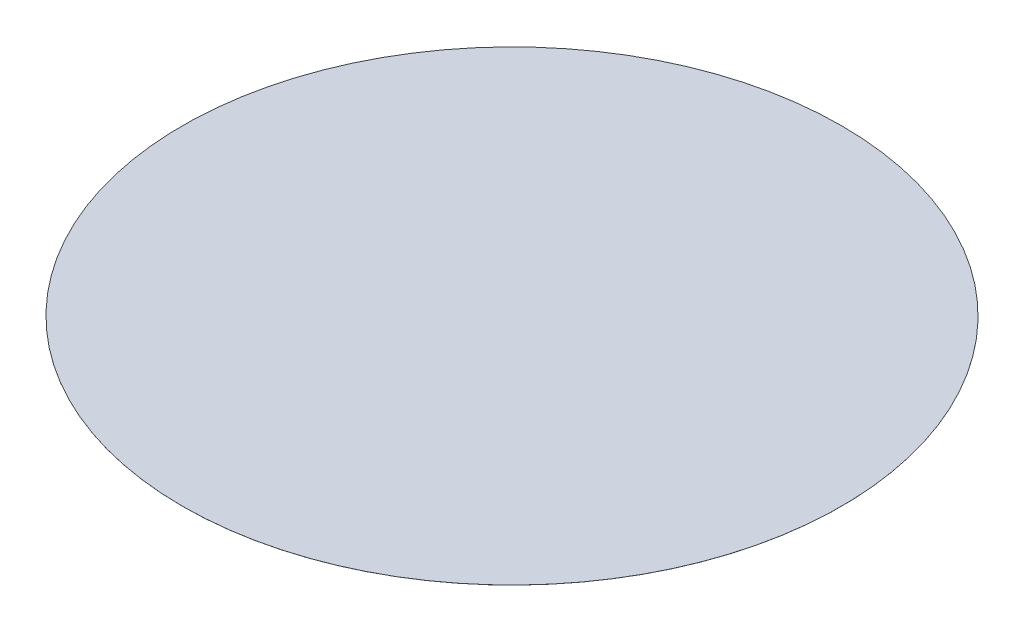
ISO-10303-21;
HEADER;
FILE_DESCRIPTION(('STEP AP214'),'2;1');
FILE_NAME('part.step','',(''),(''),'','','');
FILE_SCHEMA(('AUTOMOTIVE_DESIGN { 1 0 10303 214 1 1 1 1 }'));
ENDSEC;
DATA;
#1=APPLICATION_CONTEXT('core data for automotive mechanical design processes');
#2=APPLICATION_PROTOCOL_DEFINITION('international standard','automotive_design',2000,#1);
#3=PRODUCT_CONTEXT('',#1,'mechanical');
#4=PRODUCT('Part','Part','',(#3));
#5=PRODUCT_RELATED_PRODUCT_CATEGORY('part','',(#4));
#6=PRODUCT_DEFINITION_FORMATION('','',#4);
#7=PRODUCT_DEFINITION_CONTEXT('part definition',#1,'design');
#8=PRODUCT_DEFINITION('design','',#6,#7);
#9=PRODUCT_DEFINITION_SHAPE('','',#8);
#10=(LENGTH_UNIT() NAMED_UNIT(*) SI_UNIT(.MILLI.,.METRE.));
#11=(NAMED_UNIT(*) PLANE_ANGLE_UNIT() SI_UNIT($,.RADIAN.));
#12=(NAMED_UNIT(*) SI_UNIT($,.STERADIAN.) SOLID_ANGLE_UNIT());
#13=UNCERTAINTY_MEASURE_WITH_UNIT(LENGTH_MEASURE(1.E-05),#10,'distance_accuracy_value','');
#14=(GEOMETRIC_REPRESENTATION_CONTEXT(3) GLOBAL_UNCERTAINTY_ASSIGNED_CONTEXT((#13)) GLOBAL_UNIT_ASSIGNED_CONTEXT((#10,
#11,#12)) REPRESENTATION_CONTEXT('',''));
#15=CARTESIAN_POINT('',(0.,0.,0.));
#16=DIRECTION('',(0.,0.,1.));
#17=DIRECTION('',(1.,0.,0.));
#18=AXIS2_PLACEMENT_3D('',#15,#16,#17);
#19=CARTESIAN_POINT('',(0.,16.51,0.));
#20=DIRECTION('',(0.,-1.,0.));
#21=DIRECTION('',(0.,0.,-1.));
#22=AXIS2_PLACEMENT_3D('',#19,#20,#21);
#23=CYLINDRICAL_SURFACE('',#22,63.5);
#24=CARTESIAN_POINT('',(0.,16.51,0.));
#25=DIRECTION('',(0.,1.,0.));
#26=DIRECTION('',(0.,0.,1.));
#27=AXIS2_PLACEMENT_3D('',#24,#25,#26);
#28=CIRCLE('',#27,63.5);
#29=CARTESIAN_POINT('',(0.,16.51,63.5));
#30=VERTEX_POINT('',#29);
#31=EDGE_CURVE('E11',#30,#30,#28,.T.);
#32=ORIENTED_EDGE('',*,*,#31,.F.);
#33=EDGE_LOOP('',(#32));
#34=FACE_BOUND('',#33,.T.);
#35=CARTESIAN_POINT('',(0.,16.5,0.));
#36=DIRECTION('',(0.,1.,0.));
#37=DIRECTION('',(0.,0.,1.));
#38=AXIS2_PLACEMENT_3D('',#35,#36,#37);
#39=CIRCLE('',#38,63.5);
#40=CARTESIAN_POINT('',(0.,16.5,63.5));
#41=VERTEX_POINT('',#40);
#42=EDGE_CURVE('E48',#41,#41,#39,.T.);
#43=ORIENTED_EDGE('',*,*,#42,.T.);
#44=EDGE_LOOP('',(#43));
#45=FACE_BOUND('',#44,.T.);
#46=ADVANCED_FACE('F45',(#34,#45),#23,.T.);
#47=CARTESIAN_POINT('',(0.,16.51,0.));
#48=DIRECTION('',(0.,1.,0.));
#49=DIRECTION('',(0.,0.,1.));
#50=AXIS2_PLACEMENT_3D('',#47,#48,#49);
#51=PLANE('',#50);
#52=ORIENTED_EDGE('',*,*,#31,.T.);
#53=EDGE_LOOP('',(#52));
#54=FACE_BOUND('',#53,.T.);
#55=ADVANCED_FACE('F60',(#54),#51,.T.);
#56=CARTESIAN_POINT('',(0.,16.5,0.));
#57=DIRECTION('',(0.,1.,0.));
#58=DIRECTION('',(0.,0.,1.));
#59=AXIS2_PLACEMENT_3D('',#56,#57,#58);
#60=PLANE('',#59);
#61=ORIENTED_EDGE('',*,*,#42,.F.);
#62=EDGE_LOOP('',(#61));
#63=FACE_BOUND('',#62,.T.);
#64=ADVANCED_FACE('F58',(#63),#60,.F.);
#65=CLOSED_SHELL('',(#46,#55,#64));
#66=MANIFOLD_SOLID_BREP('B2',#65);
#67=CARTESIAN_POINT('',(0.,15.5,0.));
#68=DIRECTION('',(0.,-1.,0.));
#69=DIRECTION('',(0.,0.,-1.));
#70=AXIS2_PLACEMENT_3D('',#67,#68,#69);
#71=CYLINDRICAL_SURFACE('',#70,10.65);
#72=CARTESIAN_POINT('',(0.,15.5,0.));
#73=DIRECTION('',(0.,1.,0.));
#74=DIRECTION('',(0.,0.,1.));
#75=AXIS2_PLACEMENT_3D('',#72,#73,#74);
#76=CIRCLE('',#75,10.65);
#77=CARTESIAN_POINT('',(0.,15.5,10.65));
#78=VERTEX_POINT('',#77);
#79=EDGE_CURVE('E44',#78,#78,#76,.T.);
#80=ORIENTED_EDGE('',*,*,#79,.F.);
#81=EDGE_LOOP('',(#80));
#82=FACE_BOUND('',#81,.T.);
#83=CARTESIAN_POINT('',(0.,0.,0.));
#84=DIRECTION('',(0.,1.,0.));
#85=DIRECTION('',(0.,0.,1.));
#86=AXIS2_PLACEMENT_3D('',#83,#84,#85);
#87=CIRCLE('',#86,10.65);
#88=CARTESIAN_POINT('',(0.,0.,10.65));
#89=VERTEX_POINT('',#88);
#90=EDGE_CURVE('E89',#89,#89,#87,.T.);
#91=ORIENTED_EDGE('',*,*,#90,.T.);
#92=EDGE_LOOP('',(#91));
#93=FACE_BOUND('',#92,.T.);
#94=ADVANCED_FACE('F86',(#82,#93),#71,.T.);
#95=CARTESIAN_POINT('',(0.,15.5,0.));
#96=DIRECTION('',(0.,1.,0.));
#97=DIRECTION('',(0.,0.,1.));
#98=AXIS2_PLACEMENT_3D('',#95,#96,#97);
#99=PLANE('',#98);
#100=ORIENTED_EDGE('',*,*,#79,.T.);
#101=EDGE_LOOP('',(#100));
#102=FACE_BOUND('',#101,.T.);
#103=ADVANCED_FACE('F103',(#102),#99,.T.);
#104=CARTESIAN_POINT('',(0.,0.,0.));
#105=DIRECTION('',(0.,1.,0.));
#106=DIRECTION('',(0.,0.,1.));
#107=AXIS2_PLACEMENT_3D('',#104,#105,#106);
#108=PLANE('',#107);
#109=ORIENTED_EDGE('',*,*,#90,.F.);
#110=EDGE_LOOP('',(#109));
#111=FACE_BOUND('',#110,.T.);
#112=ADVANCED_FACE('F101',(#111),#108,.F.);
#113=CLOSED_SHELL('',(#94,#103,#112));
#114=MANIFOLD_SOLID_BREP('B6',#113);
#115=ADVANCED_BREP_SHAPE_REPRESENTATION('',(#18,#66,#114),#14);
#116=SHAPE_DEFINITION_REPRESENTATION(#9,#115);
ENDSEC;
END-ISO-10303-21;
